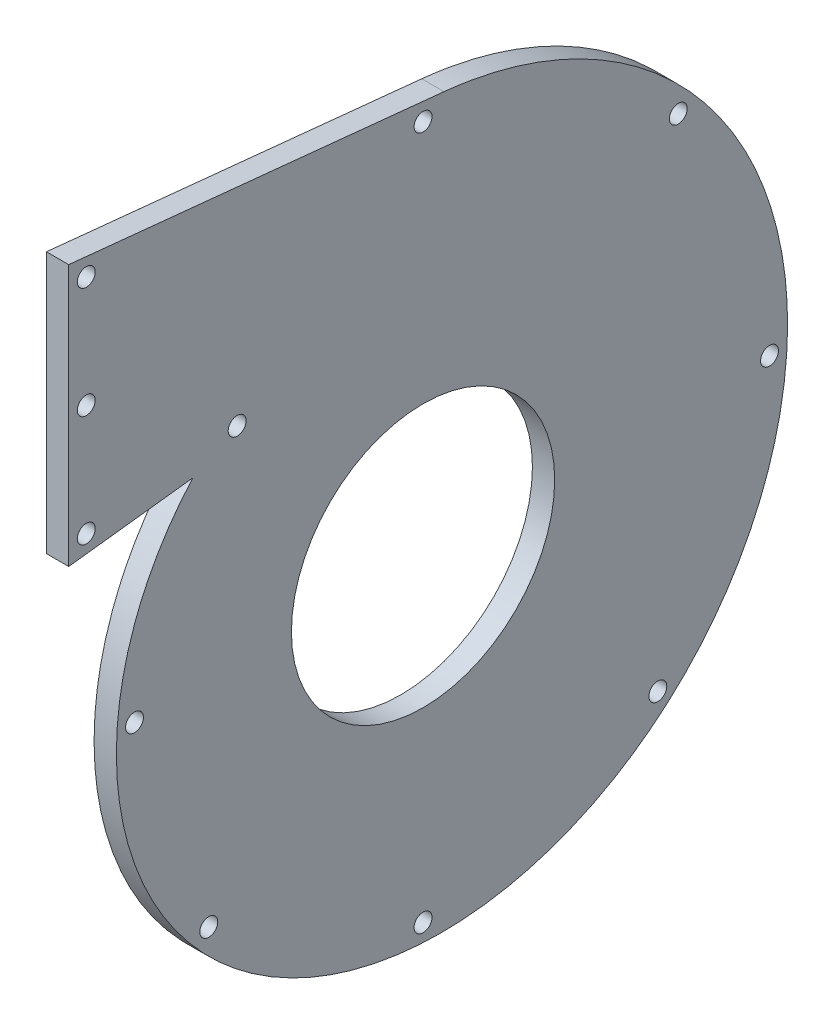
ISO-10303-21;
HEADER;
FILE_DESCRIPTION(('STEP AP214'),'2;1');
FILE_NAME('part.step','',(''),(''),'','','');
FILE_SCHEMA(('AUTOMOTIVE_DESIGN { 1 0 10303 214 1 1 1 1 }'));
ENDSEC;
DATA;
#1=APPLICATION_CONTEXT('core data for automotive mechanical design processes');
#2=APPLICATION_PROTOCOL_DEFINITION('international standard','automotive_design',2000,#1);
#3=PRODUCT_CONTEXT('',#1,'mechanical');
#4=PRODUCT('Part','Part','',(#3));
#5=PRODUCT_RELATED_PRODUCT_CATEGORY('part','',(#4));
#6=PRODUCT_DEFINITION_FORMATION('','',#4);
#7=PRODUCT_DEFINITION_CONTEXT('part definition',#1,'design');
#8=PRODUCT_DEFINITION('design','',#6,#7);
#9=PRODUCT_DEFINITION_SHAPE('','',#8);
#10=(LENGTH_UNIT() NAMED_UNIT(*) SI_UNIT(.MILLI.,.METRE.));
#11=(NAMED_UNIT(*) PLANE_ANGLE_UNIT() SI_UNIT($,.RADIAN.));
#12=(NAMED_UNIT(*) SI_UNIT($,.STERADIAN.) SOLID_ANGLE_UNIT());
#13=UNCERTAINTY_MEASURE_WITH_UNIT(LENGTH_MEASURE(1.E-05),#10,'distance_accuracy_value','');
#14=(GEOMETRIC_REPRESENTATION_CONTEXT(3) GLOBAL_UNCERTAINTY_ASSIGNED_CONTEXT((#13)) GLOBAL_UNIT_ASSIGNED_CONTEXT((#10,
#11,#12)) REPRESENTATION_CONTEXT('',''));
#15=CARTESIAN_POINT('',(0.,0.,0.));
#16=DIRECTION('',(0.,0.,1.));
#17=DIRECTION('',(1.,0.,0.));
#18=AXIS2_PLACEMENT_3D('',#15,#16,#17);
#19=CARTESIAN_POINT('',(6.35,52.0095312213766,65.5693373401911));
#20=CARTESIAN_POINT('',(6.35,48.5350696343101,68.6986331983437));
#21=CARTESIAN_POINT('',(6.35,41.0756301305955,74.3664321283952));
#22=CARTESIAN_POINT('',(6.35,24.2520637058495,83.1915350243593));
#23=CARTESIAN_POINT('',(6.35,0.571051966812408,88.8162616805835));
#24=CARTESIAN_POINT('',(6.35,-29.085280644525,85.8046077579748));
#25=CARTESIAN_POINT('',(6.35,-56.6412137555132,72.9797767825643));
#26=CARTESIAN_POINT('',(6.35,-78.8870477416462,51.4145860868805));
#27=CARTESIAN_POINT('',(6.35,-93.091773694092,23.220610692086));
#28=CARTESIAN_POINT('',(6.35,-97.3413513977909,-8.65488145362858));
#29=CARTESIAN_POINT('',(6.35,-90.7848459081721,-40.7390366050227));
#30=CARTESIAN_POINT('',(6.35,-73.7702775520646,-69.4057771791028));
#31=CARTESIAN_POINT('',(6.35,-47.8483099460183,-91.2895524381607));
#32=CARTESIAN_POINT('',(6.35,-15.6364846974259,-103.677945005173));
#33=CARTESIAN_POINT('',(6.35,19.443777188287,-104.843460982403));
#34=CARTESIAN_POINT('',(6.35,53.5337741097882,-94.2744492893508));
#35=CARTESIAN_POINT('',(6.35,77.8773899523179,-76.3494474098506));
#36=CARTESIAN_POINT('',(6.35,93.2003357726446,-57.5832170108413));
#37=CARTESIAN_POINT('',(6.35,102.269141776905,-41.6726008891398));
#38=CARTESIAN_POINT('',(6.35,107.56058488832,-27.2244570687319));
#39=CARTESIAN_POINT('',(6.35,110.322198964791,-15.1957545265602));
#40=CARTESIAN_POINT('',(6.35,111.202679979657,-9.05017451284664));
#41=CARTESIAN_POINT('',(6.35,111.5131692237,-5.97034096630008));
#42=B_SPLINE_CURVE_WITH_KNOTS('',3,(#19,#20,#21,#22,#23,#24,#25,#26,#27,#28,#29,#30,#31,#32,#33,
#34,#35,#36,#37,#38,#39,#40,#41),.UNSPECIFIED.,.F.,.F.,(4,1,1,1,1,1,1,1,1,1,1,1,1,1,1,1,1,1,1,1,
4),(0.103071112424462,0.131100140161198,0.159129167897933,0.215187223371405,0.271245278844876,
0.327303334318347,0.383361389791818,0.439419445265289,0.49547750073876,0.551535556212231,
0.607593611685702,0.663651667159173,0.719709722632644,0.775767778106116,0.831825833579587,
0.887883889053058,0.915912916789793,0.943941944526529,0.971970972263264,0.985985486131632,1.),.UNSPECIFIED.);
#43=DIRECTION('',(-1.,0.,0.));
#44=VECTOR('',#43,1.);
#45=SURFACE_OF_LINEAR_EXTRUSION('',#42,#44);
#46=CARTESIAN_POINT('',(0.,52.0095312213766,65.5693373401911));
#47=CARTESIAN_POINT('',(0.,48.5350696343101,68.6986331983437));
#48=CARTESIAN_POINT('',(0.,41.0756301305955,74.3664321283952));
#49=CARTESIAN_POINT('',(0.,24.2520637058495,83.1915350243593));
#50=CARTESIAN_POINT('',(0.,0.571051966812408,88.8162616805835));
#51=CARTESIAN_POINT('',(0.,-29.085280644525,85.8046077579748));
#52=CARTESIAN_POINT('',(0.,-56.6412137555132,72.9797767825643));
#53=CARTESIAN_POINT('',(0.,-78.8870477416462,51.4145860868805));
#54=CARTESIAN_POINT('',(0.,-93.091773694092,23.220610692086));
#55=CARTESIAN_POINT('',(0.,-97.3413513977909,-8.65488145362858));
#56=CARTESIAN_POINT('',(0.,-90.7848459081721,-40.7390366050227));
#57=CARTESIAN_POINT('',(0.,-73.7702775520646,-69.4057771791028));
#58=CARTESIAN_POINT('',(0.,-47.8483099460183,-91.2895524381607));
#59=CARTESIAN_POINT('',(0.,-15.6364846974259,-103.677945005173));
#60=CARTESIAN_POINT('',(0.,19.443777188287,-104.843460982403));
#61=CARTESIAN_POINT('',(0.,53.5337741097882,-94.2744492893508));
#62=CARTESIAN_POINT('',(0.,77.8773899523179,-76.3494474098506));
#63=CARTESIAN_POINT('',(0.,93.2003357726446,-57.5832170108413));
#64=CARTESIAN_POINT('',(0.,102.269141776905,-41.6726008891398));
#65=CARTESIAN_POINT('',(0.,107.56058488832,-27.2244570687319));
#66=CARTESIAN_POINT('',(0.,110.322198964791,-15.1957545265602));
#67=CARTESIAN_POINT('',(0.,111.202679979657,-9.05017451284664));
#68=CARTESIAN_POINT('',(0.,111.5131692237,-5.97034096630008));
#69=B_SPLINE_CURVE_WITH_KNOTS('',3,(#46,#47,#48,#49,#50,#51,#52,#53,#54,#55,#56,#57,#58,#59,#60,
#61,#62,#63,#64,#65,#66,#67,#68),.UNSPECIFIED.,.F.,.F.,(4,1,1,1,1,1,1,1,1,1,1,1,1,1,1,1,1,1,1,1,
4),(0.103071112424462,0.131100140161198,0.159129167897933,0.215187223371405,0.271245278844876,
0.327303334318347,0.383361389791818,0.439419445265289,0.49547750073876,0.551535556212231,
0.607593611685702,0.663651667159173,0.719709722632644,0.775767778106116,0.831825833579587,
0.887883889053058,0.915912916789793,0.943941944526529,0.971970972263264,0.985985486131632,1.),.UNSPECIFIED.);
#70=CARTESIAN_POINT('',(0.,52.0095312213766,65.5693373401911));
#71=VERTEX_POINT('',#70);
#72=CARTESIAN_POINT('',(0.,111.5131692237,-5.97034096630008));
#73=VERTEX_POINT('',#72);
#74=EDGE_CURVE('E96',#71,#73,#69,.T.);
#75=ORIENTED_EDGE('',*,*,#74,.T.);
#76=DIRECTION('',(-1.,0.,0.));
#77=VECTOR('',#76,1.);
#78=CARTESIAN_POINT('',(6.35,111.5131692237,-5.97034096630008));
#79=LINE('',#78,#77);
#80=CARTESIAN_POINT('',(6.35,111.5131692237,-5.97034096630008));
#81=VERTEX_POINT('',#80);
#82=EDGE_CURVE('E11',#81,#73,#79,.T.);
#83=ORIENTED_EDGE('',*,*,#82,.F.);
#84=CARTESIAN_POINT('',(6.35,52.0095312213766,65.5693373401911));
#85=VERTEX_POINT('',#84);
#86=EDGE_CURVE('E85',#85,#81,#42,.T.);
#87=ORIENTED_EDGE('',*,*,#86,.F.);
#88=DIRECTION('',(-1.,0.,0.));
#89=VECTOR('',#88,1.);
#90=CARTESIAN_POINT('',(6.35,52.0095312213766,65.5693373401911));
#91=LINE('',#90,#89);
#92=EDGE_CURVE('E93',#85,#71,#91,.T.);
#93=ORIENTED_EDGE('',*,*,#92,.T.);
#94=EDGE_LOOP('',(#75,#83,#87,#93));
#95=FACE_BOUND('',#94,.T.);
#96=ADVANCED_FACE('F33',(#95),#45,.F.);
#97=CARTESIAN_POINT('',(6.35,122.290754790352,100.935679824395));
#98=DIRECTION('',(0.,-0.994956714813608,0.100305212463325));
#99=DIRECTION('',(0.,-0.100305212463325,-0.994956714813608));
#100=AXIS2_PLACEMENT_3D('',#97,#98,#99);
#101=PLANE('',#100);
#102=DIRECTION('',(0.,0.100305212463325,0.994956714813608));
#103=VECTOR('',#102,1.);
#104=CARTESIAN_POINT('',(0.,122.290754790352,100.935679824395));
#105=LINE('',#104,#103);
#106=CARTESIAN_POINT('',(0.,122.290754790352,100.935679824395));
#107=VERTEX_POINT('',#106);
#108=EDGE_CURVE('E89',#73,#107,#105,.T.);
#109=ORIENTED_EDGE('',*,*,#108,.T.);
#110=DIRECTION('',(-1.,0.,0.));
#111=VECTOR('',#110,1.);
#112=CARTESIAN_POINT('',(6.35,122.290754790352,100.935679824395));
#113=LINE('',#112,#111);
#114=CARTESIAN_POINT('',(6.35,122.290754790352,100.935679824395));
#115=VERTEX_POINT('',#114);
#116=EDGE_CURVE('E42',#115,#107,#113,.T.);
#117=ORIENTED_EDGE('',*,*,#116,.F.);
#118=DIRECTION('',(0.,0.100305212463325,0.994956714813608));
#119=VECTOR('',#118,1.);
#120=CARTESIAN_POINT('',(6.35,122.290754790352,100.935679824395));
#121=LINE('',#120,#119);
#122=EDGE_CURVE('E80',#81,#115,#121,.T.);
#123=ORIENTED_EDGE('',*,*,#122,.F.);
#124=ORIENTED_EDGE('',*,*,#82,.T.);
#125=EDGE_LOOP('',(#109,#117,#123,#124));
#126=FACE_BOUND('',#125,.T.);
#127=ADVANCED_FACE('F88',(#126),#101,.F.);
#128=CARTESIAN_POINT('',(6.35,47.8089856985101,100.935679824395));
#129=DIRECTION('',(0.,0.,-1.));
#130=DIRECTION('',(-1.,0.,0.));
#131=AXIS2_PLACEMENT_3D('',#128,#129,#130);
#132=PLANE('',#131);
#133=DIRECTION('',(0.,-1.,0.));
#134=VECTOR('',#133,1.);
#135=CARTESIAN_POINT('',(0.,47.8089856985101,100.935679824395));
#136=LINE('',#135,#134);
#137=CARTESIAN_POINT('',(0.,47.8089856985101,100.935679824395));
#138=VERTEX_POINT('',#137);
#139=EDGE_CURVE('E67',#107,#138,#136,.T.);
#140=ORIENTED_EDGE('',*,*,#139,.T.);
#141=DIRECTION('',(-1.,0.,0.));
#142=VECTOR('',#141,1.);
#143=CARTESIAN_POINT('',(6.35,47.8089856985101,100.935679824395));
#144=LINE('',#143,#142);
#145=CARTESIAN_POINT('',(6.35,47.8089856985101,100.935679824395));
#146=VERTEX_POINT('',#145);
#147=EDGE_CURVE('E90',#146,#138,#144,.T.);
#148=ORIENTED_EDGE('',*,*,#147,.F.);
#149=DIRECTION('',(0.,-1.,0.));
#150=VECTOR('',#149,1.);
#151=CARTESIAN_POINT('',(6.35,47.8089856985101,100.935679824395));
#152=LINE('',#151,#150);
#153=EDGE_CURVE('E83',#115,#146,#152,.T.);
#154=ORIENTED_EDGE('',*,*,#153,.F.);
#155=ORIENTED_EDGE('',*,*,#116,.T.);
#156=EDGE_LOOP('',(#140,#148,#154,#155));
#157=FACE_BOUND('',#156,.T.);
#158=ADVANCED_FACE('F91',(#157),#132,.F.);
#159=CARTESIAN_POINT('',(6.35,52.0095312213766,65.5693373401911));
#160=DIRECTION('',(0.,0.993020317974937,0.11794341053639));
#161=DIRECTION('',(0.,-0.11794341053639,0.993020317974937));
#162=AXIS2_PLACEMENT_3D('',#159,#160,#161);
#163=PLANE('',#162);
#164=DIRECTION('',(0.,0.11794341053639,-0.993020317974937));
#165=VECTOR('',#164,1.);
#166=CARTESIAN_POINT('',(0.,52.0095312213766,65.5693373401911));
#167=LINE('',#166,#165);
#168=EDGE_CURVE('E73',#138,#71,#167,.T.);
#169=ORIENTED_EDGE('',*,*,#168,.T.);
#170=ORIENTED_EDGE('',*,*,#92,.F.);
#171=DIRECTION('',(0.,0.11794341053639,-0.993020317974937));
#172=VECTOR('',#171,1.);
#173=CARTESIAN_POINT('',(6.35,52.0095312213766,65.5693373401911));
#174=LINE('',#173,#172);
#175=EDGE_CURVE('E50',#146,#85,#174,.T.);
#176=ORIENTED_EDGE('',*,*,#175,.F.);
#177=ORIENTED_EDGE('',*,*,#147,.T.);
#178=EDGE_LOOP('',(#169,#170,#176,#177));
#179=FACE_BOUND('',#178,.T.);
#180=ADVANCED_FACE('F109',(#179),#163,.F.);
#181=CARTESIAN_POINT('',(6.35,-89.0418354304239,-40.1694675088037));
#182=DIRECTION('',(1.,0.,0.));
#183=DIRECTION('',(0.,0.,-1.));
#184=AXIS2_PLACEMENT_3D('',#181,#182,#183);
#185=PLANE('',#184);
#186=CARTESIAN_POINT('',(6.35,0.,0.));
#187=DIRECTION('',(1.,0.,0.));
#188=DIRECTION('',(0.,0.,-1.));
#189=AXIS2_PLACEMENT_3D('',#186,#187,#188);
#190=CIRCLE('',#189,37.5);
#191=CARTESIAN_POINT('',(6.35,0.,-37.5));
#192=VERTEX_POINT('',#191);
#193=EDGE_CURVE('E184',#192,#192,#190,.T.);
#194=ORIENTED_EDGE('',*,*,#193,.F.);
#195=EDGE_LOOP('',(#194));
#196=FACE_BOUND('',#195,.T.);
#197=CARTESIAN_POINT('',(6.35,72.7051669902108,-72.7051669902105));
#198=DIRECTION('',(1.,0.,0.));
#199=DIRECTION('',(0.,0.,-1.));
#200=AXIS2_PLACEMENT_3D('',#197,#198,#199);
#201=CIRCLE('',#200,2.54999999999999);
#202=CARTESIAN_POINT('',(6.35,72.7051669902108,-75.2551669902105));
#203=VERTEX_POINT('',#202);
#204=EDGE_CURVE('E181',#203,#203,#201,.T.);
#205=ORIENTED_EDGE('',*,*,#204,.F.);
#206=EDGE_LOOP('',(#205));
#207=FACE_BOUND('',#206,.T.);
#208=CARTESIAN_POINT('',(6.35,-66.8740788460314,-66.8740788460323));
#209=DIRECTION('',(1.,0.,0.));
#210=DIRECTION('',(0.,0.,-1.));
#211=AXIS2_PLACEMENT_3D('',#208,#209,#210);
#212=CIRCLE('',#211,2.54999999999999);
#213=CARTESIAN_POINT('',(6.35,-66.8740788460314,-69.4240788460323));
#214=VERTEX_POINT('',#213);
#215=EDGE_CURVE('E175',#214,#214,#212,.T.);
#216=ORIENTED_EDGE('',*,*,#215,.F.);
#217=EDGE_LOOP('',(#216));
#218=FACE_BOUND('',#217,.T.);
#219=CARTESIAN_POINT('',(6.35,-61.039994490338,61.0399944903385));
#220=DIRECTION('',(1.,0.,0.));
#221=DIRECTION('',(0.,0.,-1.));
#222=AXIS2_PLACEMENT_3D('',#219,#220,#221);
#223=CIRCLE('',#222,2.55);
#224=CARTESIAN_POINT('',(6.35,-61.039994490338,58.4899944903385));
#225=VERTEX_POINT('',#224);
#226=EDGE_CURVE('E169',#225,#225,#223,.T.);
#227=ORIENTED_EDGE('',*,*,#226,.F.);
#228=EDGE_LOOP('',(#227));
#229=FACE_BOUND('',#228,.T.);
#230=CARTESIAN_POINT('',(6.35,107.089716810776,0.));
#231=DIRECTION('',(1.,0.,0.));
#232=DIRECTION('',(0.,0.,-1.));
#233=AXIS2_PLACEMENT_3D('',#230,#231,#232);
#234=CIRCLE('',#233,2.55);
#235=CARTESIAN_POINT('',(6.35,107.089716810776,-2.55));
#236=VERTEX_POINT('',#235);
#237=EDGE_CURVE('E163',#236,#236,#234,.T.);
#238=ORIENTED_EDGE('',*,*,#237,.F.);
#239=EDGE_LOOP('',(#238));
#240=FACE_BOUND('',#239,.T.);
#241=CARTESIAN_POINT('',(6.35,0.,-98.6958822274498));
#242=DIRECTION('',(1.,0.,0.));
#243=DIRECTION('',(0.,0.,-1.));
#244=AXIS2_PLACEMENT_3D('',#241,#242,#243);
#245=CIRCLE('',#244,2.54999999999999);
#246=CARTESIAN_POINT('',(6.35,0.,-101.24588222745));
#247=VERTEX_POINT('',#246);
#248=EDGE_CURVE('E157',#247,#247,#245,.T.);
#249=ORIENTED_EDGE('',*,*,#248,.F.);
#250=EDGE_LOOP('',(#249));
#251=FACE_BOUND('',#250,.T.);
#252=CARTESIAN_POINT('',(6.35,-4.99262632104591E-11,82.2024791798422));
#253=DIRECTION('',(1.,0.,0.));
#254=DIRECTION('',(0.,0.,-1.));
#255=AXIS2_PLACEMENT_3D('',#252,#253,#254);
#256=CIRCLE('',#255,2.54999999999999);
#257=CARTESIAN_POINT('',(6.35,-4.99262632104591E-11,79.6524791798422));
#258=VERTEX_POINT('',#257);
#259=EDGE_CURVE('E151',#258,#258,#256,.T.);
#260=ORIENTED_EDGE('',*,*,#259,.F.);
#261=EDGE_LOOP('',(#260));
#262=FACE_BOUND('',#261,.T.);
#263=CARTESIAN_POINT('',(6.35,-90.4489628653455,0.));
#264=DIRECTION('',(1.,0.,0.));
#265=DIRECTION('',(0.,0.,-1.));
#266=AXIS2_PLACEMENT_3D('',#263,#264,#265);
#267=CIRCLE('',#266,2.55);
#268=CARTESIAN_POINT('',(6.35,-90.4489628653455,-2.55));
#269=VERTEX_POINT('',#268);
#270=EDGE_CURVE('E145',#269,#269,#267,.T.);
#271=ORIENTED_EDGE('',*,*,#270,.F.);
#272=EDGE_LOOP('',(#271));
#273=FACE_BOUND('',#272,.T.);
#274=CARTESIAN_POINT('',(6.35,58.5427770399441,52.9561202609433));
#275=DIRECTION('',(1.,0.,0.));
#276=DIRECTION('',(0.,0.,-1.));
#277=AXIS2_PLACEMENT_3D('',#274,#275,#276);
#278=CIRCLE('',#277,2.55);
#279=CARTESIAN_POINT('',(6.35,58.5427770399441,50.4061202609433));
#280=VERTEX_POINT('',#279);
#281=EDGE_CURVE('E139',#280,#280,#278,.T.);
#282=ORIENTED_EDGE('',*,*,#281,.F.);
#283=EDGE_LOOP('',(#282));
#284=FACE_BOUND('',#283,.T.);
#285=CARTESIAN_POINT('',(6.35,85.0996668726546,95.9356798243954));
#286=DIRECTION('',(1.,0.,0.));
#287=DIRECTION('',(0.,0.,-1.));
#288=AXIS2_PLACEMENT_3D('',#285,#286,#287);
#289=CIRCLE('',#288,2.54999999999999);
#290=CARTESIAN_POINT('',(6.35,85.0996668726546,93.3856798243954));
#291=VERTEX_POINT('',#290);
#292=EDGE_CURVE('E133',#291,#291,#289,.T.);
#293=ORIENTED_EDGE('',*,*,#292,.F.);
#294=EDGE_LOOP('',(#293));
#295=FACE_BOUND('',#294,.T.);
#296=CARTESIAN_POINT('',(6.35,53.4379914212541,95.9356798243954));
#297=DIRECTION('',(1.,0.,0.));
#298=DIRECTION('',(0.,0.,-1.));
#299=AXIS2_PLACEMENT_3D('',#296,#297,#298);
#300=CIRCLE('',#299,2.54999999999999);
#301=CARTESIAN_POINT('',(6.35,53.4379914212541,93.3856798243954));
#302=VERTEX_POINT('',#301);
#303=EDGE_CURVE('E127',#302,#302,#300,.T.);
#304=ORIENTED_EDGE('',*,*,#303,.F.);
#305=EDGE_LOOP('',(#304));
#306=FACE_BOUND('',#305,.T.);
#307=CARTESIAN_POINT('',(6.35,116.761342324055,95.9356798243954));
#308=DIRECTION('',(1.,0.,0.));
#309=DIRECTION('',(0.,0.,-1.));
#310=AXIS2_PLACEMENT_3D('',#307,#308,#309);
#311=CIRCLE('',#310,2.54999999999999);
#312=CARTESIAN_POINT('',(6.35,116.761342324055,93.3856798243954));
#313=VERTEX_POINT('',#312);
#314=EDGE_CURVE('E118',#313,#313,#311,.T.);
#315=ORIENTED_EDGE('',*,*,#314,.F.);
#316=EDGE_LOOP('',(#315));
#317=FACE_BOUND('',#316,.T.);
#318=ORIENTED_EDGE('',*,*,#86,.T.);
#319=ORIENTED_EDGE('',*,*,#122,.T.);
#320=ORIENTED_EDGE('',*,*,#153,.T.);
#321=ORIENTED_EDGE('',*,*,#175,.T.);
#322=EDGE_LOOP('',(#318,#319,#320,#321));
#323=FACE_BOUND('',#322,.T.);
#324=ADVANCED_FACE('F81',(#196,#207,#218,#229,#240,#251,#262,#273,#284,#295,#306,#317,#323),
#185,.T.);
#325=CARTESIAN_POINT('',(0.,-89.0418354304239,-40.1694675088037));
#326=DIRECTION('',(1.,0.,0.));
#327=DIRECTION('',(0.,0.,-1.));
#328=AXIS2_PLACEMENT_3D('',#325,#326,#327);
#329=PLANE('',#328);
#330=CARTESIAN_POINT('',(0.,0.,0.));
#331=DIRECTION('',(1.,0.,0.));
#332=DIRECTION('',(0.,0.,-1.));
#333=AXIS2_PLACEMENT_3D('',#330,#331,#332);
#334=CIRCLE('',#333,37.5);
#335=CARTESIAN_POINT('',(0.,0.,-37.5));
#336=VERTEX_POINT('',#335);
#337=EDGE_CURVE('E187',#336,#336,#334,.T.);
#338=ORIENTED_EDGE('',*,*,#337,.T.);
#339=EDGE_LOOP('',(#338));
#340=FACE_BOUND('',#339,.T.);
#341=CARTESIAN_POINT('',(0.,72.7051669902108,-72.7051669902105));
#342=DIRECTION('',(1.,0.,0.));
#343=DIRECTION('',(0.,0.,-1.));
#344=AXIS2_PLACEMENT_3D('',#341,#342,#343);
#345=CIRCLE('',#344,2.54999999999999);
#346=CARTESIAN_POINT('',(0.,72.7051669902108,-75.2551669902105));
#347=VERTEX_POINT('',#346);
#348=EDGE_CURVE('E178',#347,#347,#345,.T.);
#349=ORIENTED_EDGE('',*,*,#348,.T.);
#350=EDGE_LOOP('',(#349));
#351=FACE_BOUND('',#350,.T.);
#352=CARTESIAN_POINT('',(0.,-66.8740788460314,-66.8740788460323));
#353=DIRECTION('',(1.,0.,0.));
#354=DIRECTION('',(0.,0.,-1.));
#355=AXIS2_PLACEMENT_3D('',#352,#353,#354);
#356=CIRCLE('',#355,2.54999999999999);
#357=CARTESIAN_POINT('',(0.,-66.8740788460314,-69.4240788460323));
#358=VERTEX_POINT('',#357);
#359=EDGE_CURVE('E172',#358,#358,#356,.T.);
#360=ORIENTED_EDGE('',*,*,#359,.T.);
#361=EDGE_LOOP('',(#360));
#362=FACE_BOUND('',#361,.T.);
#363=CARTESIAN_POINT('',(0.,-61.039994490338,61.0399944903385));
#364=DIRECTION('',(1.,0.,0.));
#365=DIRECTION('',(0.,0.,-1.));
#366=AXIS2_PLACEMENT_3D('',#363,#364,#365);
#367=CIRCLE('',#366,2.55);
#368=CARTESIAN_POINT('',(0.,-61.039994490338,58.4899944903385));
#369=VERTEX_POINT('',#368);
#370=EDGE_CURVE('E166',#369,#369,#367,.T.);
#371=ORIENTED_EDGE('',*,*,#370,.T.);
#372=EDGE_LOOP('',(#371));
#373=FACE_BOUND('',#372,.T.);
#374=CARTESIAN_POINT('',(0.,107.089716810776,0.));
#375=DIRECTION('',(1.,0.,0.));
#376=DIRECTION('',(0.,0.,-1.));
#377=AXIS2_PLACEMENT_3D('',#374,#375,#376);
#378=CIRCLE('',#377,2.55);
#379=CARTESIAN_POINT('',(0.,107.089716810776,-2.55));
#380=VERTEX_POINT('',#379);
#381=EDGE_CURVE('E160',#380,#380,#378,.T.);
#382=ORIENTED_EDGE('',*,*,#381,.T.);
#383=EDGE_LOOP('',(#382));
#384=FACE_BOUND('',#383,.T.);
#385=CARTESIAN_POINT('',(0.,0.,-98.6958822274498));
#386=DIRECTION('',(1.,0.,0.));
#387=DIRECTION('',(0.,0.,-1.));
#388=AXIS2_PLACEMENT_3D('',#385,#386,#387);
#389=CIRCLE('',#388,2.54999999999999);
#390=CARTESIAN_POINT('',(0.,0.,-101.24588222745));
#391=VERTEX_POINT('',#390);
#392=EDGE_CURVE('E154',#391,#391,#389,.T.);
#393=ORIENTED_EDGE('',*,*,#392,.T.);
#394=EDGE_LOOP('',(#393));
#395=FACE_BOUND('',#394,.T.);
#396=CARTESIAN_POINT('',(0.,-4.99262632104591E-11,82.2024791798422));
#397=DIRECTION('',(1.,0.,0.));
#398=DIRECTION('',(0.,0.,-1.));
#399=AXIS2_PLACEMENT_3D('',#396,#397,#398);
#400=CIRCLE('',#399,2.54999999999999);
#401=CARTESIAN_POINT('',(0.,-4.99262632104591E-11,79.6524791798422));
#402=VERTEX_POINT('',#401);
#403=EDGE_CURVE('E148',#402,#402,#400,.T.);
#404=ORIENTED_EDGE('',*,*,#403,.T.);
#405=EDGE_LOOP('',(#404));
#406=FACE_BOUND('',#405,.T.);
#407=CARTESIAN_POINT('',(0.,-90.4489628653455,0.));
#408=DIRECTION('',(1.,0.,0.));
#409=DIRECTION('',(0.,0.,-1.));
#410=AXIS2_PLACEMENT_3D('',#407,#408,#409);
#411=CIRCLE('',#410,2.55);
#412=CARTESIAN_POINT('',(0.,-90.4489628653455,-2.55));
#413=VERTEX_POINT('',#412);
#414=EDGE_CURVE('E142',#413,#413,#411,.T.);
#415=ORIENTED_EDGE('',*,*,#414,.T.);
#416=EDGE_LOOP('',(#415));
#417=FACE_BOUND('',#416,.T.);
#418=CARTESIAN_POINT('',(0.,58.5427770399441,52.9561202609433));
#419=DIRECTION('',(1.,0.,0.));
#420=DIRECTION('',(0.,0.,-1.));
#421=AXIS2_PLACEMENT_3D('',#418,#419,#420);
#422=CIRCLE('',#421,2.55);
#423=CARTESIAN_POINT('',(0.,58.5427770399441,50.4061202609433));
#424=VERTEX_POINT('',#423);
#425=EDGE_CURVE('E136',#424,#424,#422,.T.);
#426=ORIENTED_EDGE('',*,*,#425,.T.);
#427=EDGE_LOOP('',(#426));
#428=FACE_BOUND('',#427,.T.);
#429=CARTESIAN_POINT('',(0.,85.0996668726546,95.9356798243954));
#430=DIRECTION('',(1.,0.,0.));
#431=DIRECTION('',(0.,0.,-1.));
#432=AXIS2_PLACEMENT_3D('',#429,#430,#431);
#433=CIRCLE('',#432,2.54999999999999);
#434=CARTESIAN_POINT('',(0.,85.0996668726546,93.3856798243954));
#435=VERTEX_POINT('',#434);
#436=EDGE_CURVE('E130',#435,#435,#433,.T.);
#437=ORIENTED_EDGE('',*,*,#436,.T.);
#438=EDGE_LOOP('',(#437));
#439=FACE_BOUND('',#438,.T.);
#440=CARTESIAN_POINT('',(0.,53.4379914212541,95.9356798243954));
#441=DIRECTION('',(1.,0.,0.));
#442=DIRECTION('',(0.,0.,-1.));
#443=AXIS2_PLACEMENT_3D('',#440,#441,#442);
#444=CIRCLE('',#443,2.54999999999999);
#445=CARTESIAN_POINT('',(0.,53.4379914212541,93.3856798243954));
#446=VERTEX_POINT('',#445);
#447=EDGE_CURVE('E124',#446,#446,#444,.T.);
#448=ORIENTED_EDGE('',*,*,#447,.T.);
#449=EDGE_LOOP('',(#448));
#450=FACE_BOUND('',#449,.T.);
#451=CARTESIAN_POINT('',(0.,116.761342324055,95.9356798243954));
#452=DIRECTION('',(1.,0.,0.));
#453=DIRECTION('',(0.,0.,-1.));
#454=AXIS2_PLACEMENT_3D('',#451,#452,#453);
#455=CIRCLE('',#454,2.54999999999999);
#456=CARTESIAN_POINT('',(0.,116.761342324055,93.3856798243954));
#457=VERTEX_POINT('',#456);
#458=EDGE_CURVE('E101',#457,#457,#455,.T.);
#459=ORIENTED_EDGE('',*,*,#458,.T.);
#460=EDGE_LOOP('',(#459));
#461=FACE_BOUND('',#460,.T.);
#462=ORIENTED_EDGE('',*,*,#74,.F.);
#463=ORIENTED_EDGE('',*,*,#168,.F.);
#464=ORIENTED_EDGE('',*,*,#139,.F.);
#465=ORIENTED_EDGE('',*,*,#108,.F.);
#466=EDGE_LOOP('',(#462,#463,#464,#465));
#467=FACE_BOUND('',#466,.T.);
#468=ADVANCED_FACE('F112',(#340,#351,#362,#373,#384,#395,#406,#417,#428,#439,#450,#461,#467),
#329,.F.);
#469=CARTESIAN_POINT('',(0.,116.761342324055,95.9356798243954));
#470=DIRECTION('',(1.,0.,0.));
#471=DIRECTION('',(0.,0.,-1.));
#472=AXIS2_PLACEMENT_3D('',#469,#470,#471);
#473=CYLINDRICAL_SURFACE('',#472,2.54999999999999);
#474=ORIENTED_EDGE('',*,*,#458,.F.);
#475=EDGE_LOOP('',(#474));
#476=FACE_BOUND('',#475,.T.);
#477=ORIENTED_EDGE('',*,*,#314,.T.);
#478=EDGE_LOOP('',(#477));
#479=FACE_BOUND('',#478,.T.);
#480=ADVANCED_FACE('F221',(#476,#479),#473,.F.);
#481=CARTESIAN_POINT('',(0.,53.4379914212541,95.9356798243954));
#482=DIRECTION('',(1.,0.,0.));
#483=DIRECTION('',(0.,0.,-1.));
#484=AXIS2_PLACEMENT_3D('',#481,#482,#483);
#485=CYLINDRICAL_SURFACE('',#484,2.54999999999999);
#486=ORIENTED_EDGE('',*,*,#447,.F.);
#487=EDGE_LOOP('',(#486));
#488=FACE_BOUND('',#487,.T.);
#489=ORIENTED_EDGE('',*,*,#303,.T.);
#490=EDGE_LOOP('',(#489));
#491=FACE_BOUND('',#490,.T.);
#492=ADVANCED_FACE('F223',(#488,#491),#485,.F.);
#493=CARTESIAN_POINT('',(0.,85.0996668726546,95.9356798243954));
#494=DIRECTION('',(1.,0.,0.));
#495=DIRECTION('',(0.,0.,-1.));
#496=AXIS2_PLACEMENT_3D('',#493,#494,#495);
#497=CYLINDRICAL_SURFACE('',#496,2.54999999999999);
#498=ORIENTED_EDGE('',*,*,#436,.F.);
#499=EDGE_LOOP('',(#498));
#500=FACE_BOUND('',#499,.T.);
#501=ORIENTED_EDGE('',*,*,#292,.T.);
#502=EDGE_LOOP('',(#501));
#503=FACE_BOUND('',#502,.T.);
#504=ADVANCED_FACE('F230',(#500,#503),#497,.F.);
#505=CARTESIAN_POINT('',(0.,58.5427770399441,52.9561202609433));
#506=DIRECTION('',(1.,0.,0.));
#507=DIRECTION('',(0.,0.,-1.));
#508=AXIS2_PLACEMENT_3D('',#505,#506,#507);
#509=CYLINDRICAL_SURFACE('',#508,2.55);
#510=ORIENTED_EDGE('',*,*,#425,.F.);
#511=EDGE_LOOP('',(#510));
#512=FACE_BOUND('',#511,.T.);
#513=ORIENTED_EDGE('',*,*,#281,.T.);
#514=EDGE_LOOP('',(#513));
#515=FACE_BOUND('',#514,.T.);
#516=ADVANCED_FACE('F324',(#512,#515),#509,.F.);
#517=CARTESIAN_POINT('',(0.,-90.4489628653455,0.));
#518=DIRECTION('',(1.,0.,0.));
#519=DIRECTION('',(0.,0.,-1.));
#520=AXIS2_PLACEMENT_3D('',#517,#518,#519);
#521=CYLINDRICAL_SURFACE('',#520,2.55);
#522=ORIENTED_EDGE('',*,*,#414,.F.);
#523=EDGE_LOOP('',(#522));
#524=FACE_BOUND('',#523,.T.);
#525=ORIENTED_EDGE('',*,*,#270,.T.);
#526=EDGE_LOOP('',(#525));
#527=FACE_BOUND('',#526,.T.);
#528=ADVANCED_FACE('F316',(#524,#527),#521,.F.);
#529=CARTESIAN_POINT('',(0.,-4.99262632104591E-11,82.2024791798422));
#530=DIRECTION('',(1.,0.,0.));
#531=DIRECTION('',(0.,0.,-1.));
#532=AXIS2_PLACEMENT_3D('',#529,#530,#531);
#533=CYLINDRICAL_SURFACE('',#532,2.54999999999999);
#534=ORIENTED_EDGE('',*,*,#403,.F.);
#535=EDGE_LOOP('',(#534));
#536=FACE_BOUND('',#535,.T.);
#537=ORIENTED_EDGE('',*,*,#259,.T.);
#538=EDGE_LOOP('',(#537));
#539=FACE_BOUND('',#538,.T.);
#540=ADVANCED_FACE('F308',(#536,#539),#533,.F.);
#541=CARTESIAN_POINT('',(0.,0.,-98.6958822274498));
#542=DIRECTION('',(1.,0.,0.));
#543=DIRECTION('',(0.,0.,-1.));
#544=AXIS2_PLACEMENT_3D('',#541,#542,#543);
#545=CYLINDRICAL_SURFACE('',#544,2.54999999999999);
#546=ORIENTED_EDGE('',*,*,#392,.F.);
#547=EDGE_LOOP('',(#546));
#548=FACE_BOUND('',#547,.T.);
#549=ORIENTED_EDGE('',*,*,#248,.T.);
#550=EDGE_LOOP('',(#549));
#551=FACE_BOUND('',#550,.T.);
#552=ADVANCED_FACE('F300',(#548,#551),#545,.F.);
#553=CARTESIAN_POINT('',(0.,107.089716810776,0.));
#554=DIRECTION('',(1.,0.,0.));
#555=DIRECTION('',(0.,0.,-1.));
#556=AXIS2_PLACEMENT_3D('',#553,#554,#555);
#557=CYLINDRICAL_SURFACE('',#556,2.55);
#558=ORIENTED_EDGE('',*,*,#381,.F.);
#559=EDGE_LOOP('',(#558));
#560=FACE_BOUND('',#559,.T.);
#561=ORIENTED_EDGE('',*,*,#237,.T.);
#562=EDGE_LOOP('',(#561));
#563=FACE_BOUND('',#562,.T.);
#564=ADVANCED_FACE('F292',(#560,#563),#557,.F.);
#565=CARTESIAN_POINT('',(0.,-61.039994490338,61.0399944903385));
#566=DIRECTION('',(1.,0.,0.));
#567=DIRECTION('',(0.,0.,-1.));
#568=AXIS2_PLACEMENT_3D('',#565,#566,#567);
#569=CYLINDRICAL_SURFACE('',#568,2.55);
#570=ORIENTED_EDGE('',*,*,#370,.F.);
#571=EDGE_LOOP('',(#570));
#572=FACE_BOUND('',#571,.T.);
#573=ORIENTED_EDGE('',*,*,#226,.T.);
#574=EDGE_LOOP('',(#573));
#575=FACE_BOUND('',#574,.T.);
#576=ADVANCED_FACE('F284',(#572,#575),#569,.F.);
#577=CARTESIAN_POINT('',(0.,-66.8740788460314,-66.8740788460323));
#578=DIRECTION('',(1.,0.,0.));
#579=DIRECTION('',(0.,0.,-1.));
#580=AXIS2_PLACEMENT_3D('',#577,#578,#579);
#581=CYLINDRICAL_SURFACE('',#580,2.54999999999999);
#582=ORIENTED_EDGE('',*,*,#359,.F.);
#583=EDGE_LOOP('',(#582));
#584=FACE_BOUND('',#583,.T.);
#585=ORIENTED_EDGE('',*,*,#215,.T.);
#586=EDGE_LOOP('',(#585));
#587=FACE_BOUND('',#586,.T.);
#588=ADVANCED_FACE('F277',(#584,#587),#581,.F.);
#589=CARTESIAN_POINT('',(0.,72.7051669902108,-72.7051669902105));
#590=DIRECTION('',(1.,0.,0.));
#591=DIRECTION('',(0.,0.,-1.));
#592=AXIS2_PLACEMENT_3D('',#589,#590,#591);
#593=CYLINDRICAL_SURFACE('',#592,2.54999999999999);
#594=ORIENTED_EDGE('',*,*,#348,.F.);
#595=EDGE_LOOP('',(#594));
#596=FACE_BOUND('',#595,.T.);
#597=ORIENTED_EDGE('',*,*,#204,.T.);
#598=EDGE_LOOP('',(#597));
#599=FACE_BOUND('',#598,.T.);
#600=ADVANCED_FACE('F268',(#596,#599),#593,.F.);
#601=CARTESIAN_POINT('',(6.35,0.,0.));
#602=DIRECTION('',(-1.,0.,0.));
#603=DIRECTION('',(0.,0.,1.));
#604=AXIS2_PLACEMENT_3D('',#601,#602,#603);
#605=CYLINDRICAL_SURFACE('',#604,37.5);
#606=ORIENTED_EDGE('',*,*,#193,.T.);
#607=EDGE_LOOP('',(#606));
#608=FACE_BOUND('',#607,.T.);
#609=ORIENTED_EDGE('',*,*,#337,.F.);
#610=EDGE_LOOP('',(#609));
#611=FACE_BOUND('',#610,.T.);
#612=ADVANCED_FACE('F193',(#608,#611),#605,.F.);
#613=CLOSED_SHELL('',(#96,#127,#158,#180,#324,#468,#480,#492,#504,#516,#528,#540,#552,#564,#576,
#588,#600,#612));
#614=MANIFOLD_SOLID_BREP('B2',#613);
#615=ADVANCED_BREP_SHAPE_REPRESENTATION('',(#18,#614),#14);
#616=SHAPE_DEFINITION_REPRESENTATION(#9,#615);
ENDSEC;
END-ISO-10303-21;
